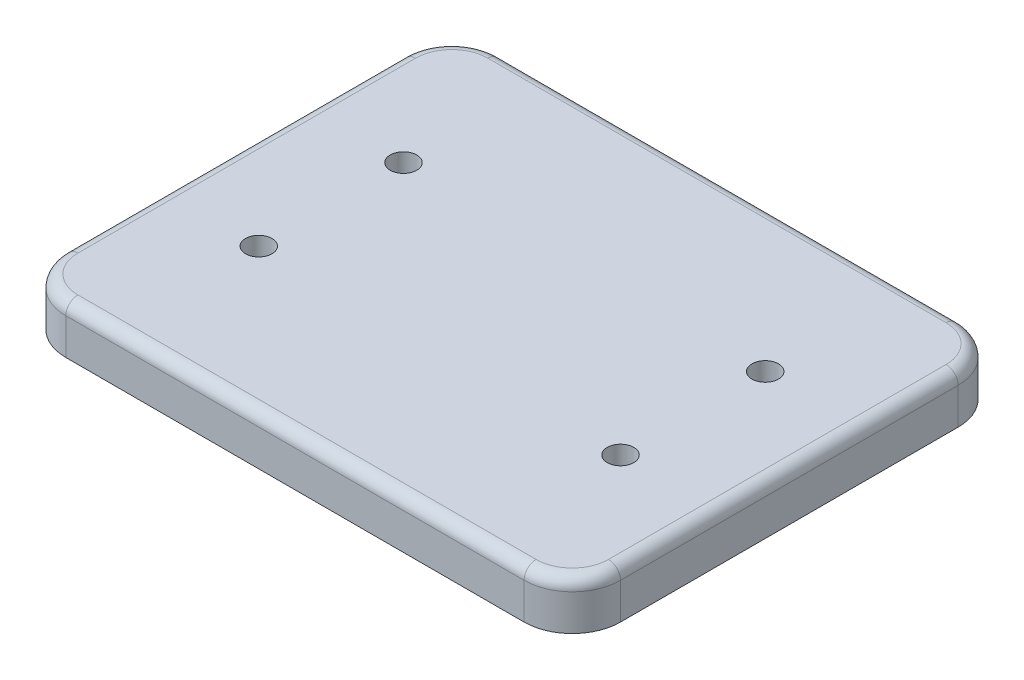
ISO-10303-21;
HEADER;
FILE_DESCRIPTION(('STEP AP214'),'2;1');
FILE_NAME('part.step','',(''),(''),'','','');
FILE_SCHEMA(('AUTOMOTIVE_DESIGN { 1 0 10303 214 1 1 1 1 }'));
ENDSEC;
DATA;
#1=APPLICATION_CONTEXT('core data for automotive mechanical design processes');
#2=APPLICATION_PROTOCOL_DEFINITION('international standard','automotive_design',2000,#1);
#3=PRODUCT_CONTEXT('',#1,'mechanical');
#4=PRODUCT('Part','Part','',(#3));
#5=PRODUCT_RELATED_PRODUCT_CATEGORY('part','',(#4));
#6=PRODUCT_DEFINITION_FORMATION('','',#4);
#7=PRODUCT_DEFINITION_CONTEXT('part definition',#1,'design');
#8=PRODUCT_DEFINITION('design','',#6,#7);
#9=PRODUCT_DEFINITION_SHAPE('','',#8);
#10=(LENGTH_UNIT() NAMED_UNIT(*) SI_UNIT(.MILLI.,.METRE.));
#11=(NAMED_UNIT(*) PLANE_ANGLE_UNIT() SI_UNIT($,.RADIAN.));
#12=(NAMED_UNIT(*) SI_UNIT($,.STERADIAN.) SOLID_ANGLE_UNIT());
#13=UNCERTAINTY_MEASURE_WITH_UNIT(LENGTH_MEASURE(1.E-05),#10,'distance_accuracy_value','');
#14=(GEOMETRIC_REPRESENTATION_CONTEXT(3) GLOBAL_UNCERTAINTY_ASSIGNED_CONTEXT((#13)) GLOBAL_UNIT_ASSIGNED_CONTEXT((#10,
#11,#12)) REPRESENTATION_CONTEXT('',''));
#15=CARTESIAN_POINT('',(0.,0.,0.));
#16=DIRECTION('',(0.,0.,1.));
#17=DIRECTION('',(1.,0.,0.));
#18=AXIS2_PLACEMENT_3D('',#15,#16,#17);
#19=CARTESIAN_POINT('',(75.,0.,30.));
#20=DIRECTION('',(0.,1.,0.));
#21=DIRECTION('',(0.,0.,1.));
#22=AXIS2_PLACEMENT_3D('',#19,#20,#21);
#23=CYLINDRICAL_SURFACE('',#22,5.5);
#24=CARTESIAN_POINT('',(75.,20.,30.));
#25=DIRECTION('',(0.,-1.,0.));
#26=DIRECTION('',(0.,0.,-1.));
#27=AXIS2_PLACEMENT_3D('',#24,#25,#26);
#28=CIRCLE('',#27,5.5);
#29=CARTESIAN_POINT('',(75.,20.,24.5));
#30=VERTEX_POINT('',#29);
#31=EDGE_CURVE('E297',#30,#30,#28,.T.);
#32=ORIENTED_EDGE('',*,*,#31,.F.);
#33=EDGE_LOOP('',(#32));
#34=FACE_BOUND('',#33,.T.);
#35=CARTESIAN_POINT('',(75.,11.,30.));
#36=DIRECTION('',(0.,-1.,0.));
#37=DIRECTION('',(0.,0.,-1.));
#38=AXIS2_PLACEMENT_3D('',#35,#36,#37);
#39=CIRCLE('',#38,5.5);
#40=CARTESIAN_POINT('',(75.,11.,24.5));
#41=VERTEX_POINT('',#40);
#42=EDGE_CURVE('E45',#41,#41,#39,.T.);
#43=ORIENTED_EDGE('',*,*,#42,.T.);
#44=EDGE_LOOP('',(#43));
#45=FACE_BOUND('',#44,.T.);
#46=ADVANCED_FACE('F41',(#34,#45),#23,.F.);
#47=CARTESIAN_POINT('',(-75.,0.,30.));
#48=DIRECTION('',(0.,1.,0.));
#49=DIRECTION('',(0.,0.,1.));
#50=AXIS2_PLACEMENT_3D('',#47,#48,#49);
#51=CYLINDRICAL_SURFACE('',#50,5.5);
#52=CARTESIAN_POINT('',(-75.,20.,30.));
#53=DIRECTION('',(0.,-1.,0.));
#54=DIRECTION('',(0.,0.,-1.));
#55=AXIS2_PLACEMENT_3D('',#52,#53,#54);
#56=CIRCLE('',#55,5.5);
#57=CARTESIAN_POINT('',(-75.,20.,24.5));
#58=VERTEX_POINT('',#57);
#59=EDGE_CURVE('E315',#58,#58,#56,.T.);
#60=ORIENTED_EDGE('',*,*,#59,.F.);
#61=EDGE_LOOP('',(#60));
#62=FACE_BOUND('',#61,.T.);
#63=CARTESIAN_POINT('',(-75.,11.,30.));
#64=DIRECTION('',(0.,-1.,0.));
#65=DIRECTION('',(0.,0.,-1.));
#66=AXIS2_PLACEMENT_3D('',#63,#64,#65);
#67=CIRCLE('',#66,5.5);
#68=CARTESIAN_POINT('',(-75.,11.,24.5));
#69=VERTEX_POINT('',#68);
#70=EDGE_CURVE('E288',#69,#69,#67,.T.);
#71=ORIENTED_EDGE('',*,*,#70,.T.);
#72=EDGE_LOOP('',(#71));
#73=FACE_BOUND('',#72,.T.);
#74=ADVANCED_FACE('F407',(#62,#73),#51,.F.);
#75=CARTESIAN_POINT('',(75.,0.,-30.));
#76=DIRECTION('',(0.,1.,0.));
#77=DIRECTION('',(0.,0.,1.));
#78=AXIS2_PLACEMENT_3D('',#75,#76,#77);
#79=CYLINDRICAL_SURFACE('',#78,5.5);
#80=CARTESIAN_POINT('',(75.,20.,-30.));
#81=DIRECTION('',(0.,1.,0.));
#82=DIRECTION('',(0.,0.,1.));
#83=AXIS2_PLACEMENT_3D('',#80,#81,#82);
#84=CIRCLE('',#83,5.5);
#85=CARTESIAN_POINT('',(75.,20.,-24.5));
#86=VERTEX_POINT('',#85);
#87=EDGE_CURVE('E168',#86,#86,#84,.T.);
#88=ORIENTED_EDGE('',*,*,#87,.T.);
#89=EDGE_LOOP('',(#88));
#90=FACE_BOUND('',#89,.T.);
#91=CARTESIAN_POINT('',(75.,11.,-30.));
#92=DIRECTION('',(0.,-1.,0.));
#93=DIRECTION('',(0.,0.,-1.));
#94=AXIS2_PLACEMENT_3D('',#91,#92,#93);
#95=CIRCLE('',#94,5.5);
#96=CARTESIAN_POINT('',(75.,11.,-35.5));
#97=VERTEX_POINT('',#96);
#98=EDGE_CURVE('E284',#97,#97,#95,.F.);
#99=ORIENTED_EDGE('',*,*,#98,.F.);
#100=EDGE_LOOP('',(#99));
#101=FACE_BOUND('',#100,.T.);
#102=ADVANCED_FACE('F344',(#90,#101),#79,.F.);
#103=CARTESIAN_POINT('',(-75.,0.,-30.));
#104=DIRECTION('',(0.,1.,0.));
#105=DIRECTION('',(0.,0.,1.));
#106=AXIS2_PLACEMENT_3D('',#103,#104,#105);
#107=CYLINDRICAL_SURFACE('',#106,5.5);
#108=CARTESIAN_POINT('',(-75.,20.,-30.));
#109=DIRECTION('',(0.,1.,0.));
#110=DIRECTION('',(0.,0.,1.));
#111=AXIS2_PLACEMENT_3D('',#108,#109,#110);
#112=CIRCLE('',#111,5.5);
#113=CARTESIAN_POINT('',(-75.,20.,-24.5));
#114=VERTEX_POINT('',#113);
#115=EDGE_CURVE('E258',#114,#114,#112,.T.);
#116=ORIENTED_EDGE('',*,*,#115,.T.);
#117=EDGE_LOOP('',(#116));
#118=FACE_BOUND('',#117,.T.);
#119=CARTESIAN_POINT('',(-75.,11.,-30.));
#120=DIRECTION('',(0.,-1.,0.));
#121=DIRECTION('',(0.,0.,-1.));
#122=AXIS2_PLACEMENT_3D('',#119,#120,#121);
#123=CIRCLE('',#122,5.5);
#124=CARTESIAN_POINT('',(-75.,11.,-35.5));
#125=VERTEX_POINT('',#124);
#126=EDGE_CURVE('E280',#125,#125,#123,.F.);
#127=ORIENTED_EDGE('',*,*,#126,.F.);
#128=EDGE_LOOP('',(#127));
#129=FACE_BOUND('',#128,.T.);
#130=ADVANCED_FACE('F436',(#118,#129),#107,.F.);
#131=CARTESIAN_POINT('',(-95.,20.,70.));
#132=DIRECTION('',(0.,-1.,0.));
#133=DIRECTION('',(0.,0.,-1.));
#134=AXIS2_PLACEMENT_3D('',#131,#132,#133);
#135=CYLINDRICAL_SURFACE('',#134,20.);
#136=DIRECTION('',(0.,-1.,0.));
#137=VECTOR('',#136,1.);
#138=CARTESIAN_POINT('',(-94.9999999999998,20.,90.));
#139=LINE('',#138,#137);
#140=CARTESIAN_POINT('',(-94.9999999999998,15.,90.));
#141=VERTEX_POINT('',#140);
#142=CARTESIAN_POINT('',(-94.9999999999998,0.,90.));
#143=VERTEX_POINT('',#142);
#144=EDGE_CURVE('E132',#141,#143,#139,.T.);
#145=ORIENTED_EDGE('',*,*,#144,.F.);
#146=CARTESIAN_POINT('',(-95.,15.,70.));
#147=DIRECTION('',(0.,1.,0.));
#148=DIRECTION('',(0.,0.,1.));
#149=AXIS2_PLACEMENT_3D('',#146,#147,#148);
#150=CIRCLE('',#149,20.);
#151=CARTESIAN_POINT('',(-115.,15.,69.9999999999999));
#152=VERTEX_POINT('',#151);
#153=EDGE_CURVE('E235',#141,#152,#150,.F.);
#154=ORIENTED_EDGE('',*,*,#153,.T.);
#155=DIRECTION('',(0.,-1.,0.));
#156=VECTOR('',#155,1.);
#157=CARTESIAN_POINT('',(-115.,20.,69.9999999999999));
#158=LINE('',#157,#156);
#159=CARTESIAN_POINT('',(-115.,0.,69.9999999999999));
#160=VERTEX_POINT('',#159);
#161=EDGE_CURVE('E158',#152,#160,#158,.T.);
#162=ORIENTED_EDGE('',*,*,#161,.T.);
#163=CARTESIAN_POINT('',(-95.,0.,70.));
#164=DIRECTION('',(0.,1.,0.));
#165=DIRECTION('',(0.,0.,1.));
#166=AXIS2_PLACEMENT_3D('',#163,#164,#165);
#167=CIRCLE('',#166,20.);
#168=EDGE_CURVE('E150',#160,#143,#167,.T.);
#169=ORIENTED_EDGE('',*,*,#168,.T.);
#170=EDGE_LOOP('',(#145,#154,#162,#169));
#171=FACE_BOUND('',#170,.T.);
#172=ADVANCED_FACE('F156',(#171),#135,.T.);
#173=CARTESIAN_POINT('',(-94.9999999999998,20.,90.));
#174=DIRECTION('',(0.,0.,-1.));
#175=DIRECTION('',(-1.,0.,0.));
#176=AXIS2_PLACEMENT_3D('',#173,#174,#175);
#177=PLANE('',#176);
#178=DIRECTION('',(0.,-1.,0.));
#179=VECTOR('',#178,1.);
#180=CARTESIAN_POINT('',(94.9999999999998,20.,90.));
#181=LINE('',#180,#179);
#182=CARTESIAN_POINT('',(94.9999999999998,15.,90.));
#183=VERTEX_POINT('',#182);
#184=CARTESIAN_POINT('',(94.9999999999998,0.,90.));
#185=VERTEX_POINT('',#184);
#186=EDGE_CURVE('E144',#183,#185,#181,.T.);
#187=ORIENTED_EDGE('',*,*,#186,.F.);
#188=DIRECTION('',(1.,0.,0.));
#189=VECTOR('',#188,1.);
#190=CARTESIAN_POINT('',(-94.9999999999998,15.,90.));
#191=LINE('',#190,#189);
#192=EDGE_CURVE('E11',#183,#141,#191,.F.);
#193=ORIENTED_EDGE('',*,*,#192,.T.);
#194=ORIENTED_EDGE('',*,*,#144,.T.);
#195=DIRECTION('',(1.,0.,0.));
#196=VECTOR('',#195,1.);
#197=CARTESIAN_POINT('',(-94.9999999999998,0.,90.));
#198=LINE('',#197,#196);
#199=EDGE_CURVE('E135',#143,#185,#198,.T.);
#200=ORIENTED_EDGE('',*,*,#199,.T.);
#201=EDGE_LOOP('',(#187,#193,#194,#200));
#202=FACE_BOUND('',#201,.T.);
#203=ADVANCED_FACE('F134',(#202),#177,.F.);
#204=CARTESIAN_POINT('',(95.,20.,70.));
#205=DIRECTION('',(0.,-1.,0.));
#206=DIRECTION('',(0.,0.,-1.));
#207=AXIS2_PLACEMENT_3D('',#204,#205,#206);
#208=CYLINDRICAL_SURFACE('',#207,20.);
#209=DIRECTION('',(0.,-1.,0.));
#210=VECTOR('',#209,1.);
#211=CARTESIAN_POINT('',(115.,20.,69.9999999999999));
#212=LINE('',#211,#210);
#213=CARTESIAN_POINT('',(115.,15.,69.9999999999999));
#214=VERTEX_POINT('',#213);
#215=CARTESIAN_POINT('',(115.,0.,69.9999999999999));
#216=VERTEX_POINT('',#215);
#217=EDGE_CURVE('E206',#214,#216,#212,.T.);
#218=ORIENTED_EDGE('',*,*,#217,.F.);
#219=CARTESIAN_POINT('',(95.,15.,70.));
#220=DIRECTION('',(0.,1.,0.));
#221=DIRECTION('',(0.,0.,1.));
#222=AXIS2_PLACEMENT_3D('',#219,#220,#221);
#223=CIRCLE('',#222,20.);
#224=EDGE_CURVE('E51',#214,#183,#223,.F.);
#225=ORIENTED_EDGE('',*,*,#224,.T.);
#226=ORIENTED_EDGE('',*,*,#186,.T.);
#227=CARTESIAN_POINT('',(95.,0.,70.));
#228=DIRECTION('',(0.,1.,0.));
#229=DIRECTION('',(0.,0.,-1.));
#230=AXIS2_PLACEMENT_3D('',#227,#228,#229);
#231=CIRCLE('',#230,20.);
#232=EDGE_CURVE('E153',#185,#216,#231,.T.);
#233=ORIENTED_EDGE('',*,*,#232,.T.);
#234=EDGE_LOOP('',(#218,#225,#226,#233));
#235=FACE_BOUND('',#234,.T.);
#236=ADVANCED_FACE('F627',(#235),#208,.T.);
#237=CARTESIAN_POINT('',(115.,20.,69.9999999999999));
#238=DIRECTION('',(-1.,0.,0.));
#239=DIRECTION('',(0.,0.,1.));
#240=AXIS2_PLACEMENT_3D('',#237,#238,#239);
#241=PLANE('',#240);
#242=DIRECTION('',(0.,-1.,0.));
#243=VECTOR('',#242,1.);
#244=CARTESIAN_POINT('',(115.,20.,-69.9999999999999));
#245=LINE('',#244,#243);
#246=CARTESIAN_POINT('',(115.,15.,-69.9999999999999));
#247=VERTEX_POINT('',#246);
#248=CARTESIAN_POINT('',(115.,0.,-69.9999999999999));
#249=VERTEX_POINT('',#248);
#250=EDGE_CURVE('E203',#247,#249,#245,.T.);
#251=ORIENTED_EDGE('',*,*,#250,.F.);
#252=DIRECTION('',(0.,0.,-1.));
#253=VECTOR('',#252,1.);
#254=CARTESIAN_POINT('',(115.,15.,69.9999999999999));
#255=LINE('',#254,#253);
#256=EDGE_CURVE('E66',#247,#214,#255,.F.);
#257=ORIENTED_EDGE('',*,*,#256,.T.);
#258=ORIENTED_EDGE('',*,*,#217,.T.);
#259=DIRECTION('',(0.,0.,-1.));
#260=VECTOR('',#259,1.);
#261=CARTESIAN_POINT('',(115.,0.,69.9999999999999));
#262=LINE('',#261,#260);
#263=EDGE_CURVE('E173',#216,#249,#262,.T.);
#264=ORIENTED_EDGE('',*,*,#263,.T.);
#265=EDGE_LOOP('',(#251,#257,#258,#264));
#266=FACE_BOUND('',#265,.T.);
#267=ADVANCED_FACE('F618',(#266),#241,.F.);
#268=CARTESIAN_POINT('',(95.,20.,-70.));
#269=DIRECTION('',(0.,-1.,0.));
#270=DIRECTION('',(0.,0.,-1.));
#271=AXIS2_PLACEMENT_3D('',#268,#269,#270);
#272=CYLINDRICAL_SURFACE('',#271,20.);
#273=DIRECTION('',(0.,-1.,0.));
#274=VECTOR('',#273,1.);
#275=CARTESIAN_POINT('',(94.9999999999998,20.,-90.));
#276=LINE('',#275,#274);
#277=CARTESIAN_POINT('',(94.9999999999998,15.,-90.));
#278=VERTEX_POINT('',#277);
#279=CARTESIAN_POINT('',(94.9999999999998,0.,-90.));
#280=VERTEX_POINT('',#279);
#281=EDGE_CURVE('E200',#278,#280,#276,.T.);
#282=ORIENTED_EDGE('',*,*,#281,.F.);
#283=CARTESIAN_POINT('',(95.,15.,-70.));
#284=DIRECTION('',(0.,1.,0.));
#285=DIRECTION('',(0.,0.,1.));
#286=AXIS2_PLACEMENT_3D('',#283,#284,#285);
#287=CIRCLE('',#286,20.);
#288=EDGE_CURVE('E247',#278,#247,#287,.F.);
#289=ORIENTED_EDGE('',*,*,#288,.T.);
#290=ORIENTED_EDGE('',*,*,#250,.T.);
#291=CARTESIAN_POINT('',(95.,0.,-70.));
#292=DIRECTION('',(0.,1.,0.));
#293=DIRECTION('',(0.,0.,1.));
#294=AXIS2_PLACEMENT_3D('',#291,#292,#293);
#295=CIRCLE('',#294,20.);
#296=EDGE_CURVE('E177',#249,#280,#295,.T.);
#297=ORIENTED_EDGE('',*,*,#296,.T.);
#298=EDGE_LOOP('',(#282,#289,#290,#297));
#299=FACE_BOUND('',#298,.T.);
#300=ADVANCED_FACE('F610',(#299),#272,.T.);
#301=CARTESIAN_POINT('',(94.9999999999998,20.,-90.));
#302=DIRECTION('',(0.,0.,1.));
#303=DIRECTION('',(1.,0.,0.));
#304=AXIS2_PLACEMENT_3D('',#301,#302,#303);
#305=PLANE('',#304);
#306=DIRECTION('',(0.,-1.,0.));
#307=VECTOR('',#306,1.);
#308=CARTESIAN_POINT('',(-94.9999999999999,20.,-90.));
#309=LINE('',#308,#307);
#310=CARTESIAN_POINT('',(-94.9999999999999,15.,-90.));
#311=VERTEX_POINT('',#310);
#312=CARTESIAN_POINT('',(-94.9999999999999,0.,-90.));
#313=VERTEX_POINT('',#312);
#314=EDGE_CURVE('E197',#311,#313,#309,.T.);
#315=ORIENTED_EDGE('',*,*,#314,.F.);
#316=DIRECTION('',(-1.,0.,0.));
#317=VECTOR('',#316,1.);
#318=CARTESIAN_POINT('',(94.9999999999999,15.,-90.));
#319=LINE('',#318,#317);
#320=EDGE_CURVE('E244',#311,#278,#319,.F.);
#321=ORIENTED_EDGE('',*,*,#320,.T.);
#322=ORIENTED_EDGE('',*,*,#281,.T.);
#323=DIRECTION('',(-1.,0.,0.));
#324=VECTOR('',#323,1.);
#325=CARTESIAN_POINT('',(94.9999999999998,0.,-90.));
#326=LINE('',#325,#324);
#327=EDGE_CURVE('E181',#280,#313,#326,.T.);
#328=ORIENTED_EDGE('',*,*,#327,.T.);
#329=EDGE_LOOP('',(#315,#321,#322,#328));
#330=FACE_BOUND('',#329,.T.);
#331=ADVANCED_FACE('F393',(#330),#305,.F.);
#332=CARTESIAN_POINT('',(-95.,20.,-70.));
#333=DIRECTION('',(0.,-1.,0.));
#334=DIRECTION('',(0.,0.,-1.));
#335=AXIS2_PLACEMENT_3D('',#332,#333,#334);
#336=CYLINDRICAL_SURFACE('',#335,20.);
#337=DIRECTION('',(0.,-1.,0.));
#338=VECTOR('',#337,1.);
#339=CARTESIAN_POINT('',(-115.,20.,-69.9999999999998));
#340=LINE('',#339,#338);
#341=CARTESIAN_POINT('',(-115.,15.,-69.9999999999998));
#342=VERTEX_POINT('',#341);
#343=CARTESIAN_POINT('',(-115.,0.,-69.9999999999998));
#344=VERTEX_POINT('',#343);
#345=EDGE_CURVE('E194',#342,#344,#340,.T.);
#346=ORIENTED_EDGE('',*,*,#345,.F.);
#347=CARTESIAN_POINT('',(-95.,15.,-70.));
#348=DIRECTION('',(0.,1.,0.));
#349=DIRECTION('',(0.,0.,1.));
#350=AXIS2_PLACEMENT_3D('',#347,#348,#349);
#351=CIRCLE('',#350,20.);
#352=EDGE_CURVE('E241',#342,#311,#351,.F.);
#353=ORIENTED_EDGE('',*,*,#352,.T.);
#354=ORIENTED_EDGE('',*,*,#314,.T.);
#355=CARTESIAN_POINT('',(-95.,0.,-70.));
#356=DIRECTION('',(0.,1.,0.));
#357=DIRECTION('',(0.,0.,1.));
#358=AXIS2_PLACEMENT_3D('',#355,#356,#357);
#359=CIRCLE('',#358,20.);
#360=EDGE_CURVE('E185',#313,#344,#359,.T.);
#361=ORIENTED_EDGE('',*,*,#360,.T.);
#362=EDGE_LOOP('',(#346,#353,#354,#361));
#363=FACE_BOUND('',#362,.T.);
#364=ADVANCED_FACE('F391',(#363),#336,.T.);
#365=CARTESIAN_POINT('',(-115.,20.,-69.9999999999998));
#366=DIRECTION('',(1.,0.,0.));
#367=DIRECTION('',(0.,0.,-1.));
#368=AXIS2_PLACEMENT_3D('',#365,#366,#367);
#369=PLANE('',#368);
#370=ORIENTED_EDGE('',*,*,#161,.F.);
#371=DIRECTION('',(0.,0.,1.));
#372=VECTOR('',#371,1.);
#373=CARTESIAN_POINT('',(-115.,15.,-69.9999999999998));
#374=LINE('',#373,#372);
#375=EDGE_CURVE('E238',#152,#342,#374,.F.);
#376=ORIENTED_EDGE('',*,*,#375,.T.);
#377=ORIENTED_EDGE('',*,*,#345,.T.);
#378=DIRECTION('',(0.,0.,1.));
#379=VECTOR('',#378,1.);
#380=CARTESIAN_POINT('',(-115.,0.,-69.9999999999998));
#381=LINE('',#380,#379);
#382=EDGE_CURVE('E189',#344,#160,#381,.T.);
#383=ORIENTED_EDGE('',*,*,#382,.T.);
#384=EDGE_LOOP('',(#370,#376,#377,#383));
#385=FACE_BOUND('',#384,.T.);
#386=ADVANCED_FACE('F350',(#385),#369,.F.);
#387=CARTESIAN_POINT('',(-95.,20.,70.));
#388=DIRECTION('',(0.,1.,0.));
#389=DIRECTION('',(0.,0.,1.));
#390=AXIS2_PLACEMENT_3D('',#387,#388,#389);
#391=PLANE('',#390);
#392=ORIENTED_EDGE('',*,*,#59,.T.);
#393=EDGE_LOOP('',(#392));
#394=FACE_BOUND('',#393,.T.);
#395=ORIENTED_EDGE('',*,*,#31,.T.);
#396=EDGE_LOOP('',(#395));
#397=FACE_BOUND('',#396,.T.);
#398=ORIENTED_EDGE('',*,*,#115,.F.);
#399=EDGE_LOOP('',(#398));
#400=FACE_BOUND('',#399,.T.);
#401=ORIENTED_EDGE('',*,*,#87,.F.);
#402=EDGE_LOOP('',(#401));
#403=FACE_BOUND('',#402,.T.);
#404=DIRECTION('',(0.,0.,1.));
#405=VECTOR('',#404,1.);
#406=CARTESIAN_POINT('',(-110.,20.,69.9999999999999));
#407=LINE('',#406,#405);
#408=CARTESIAN_POINT('',(-110.,20.,-69.9999999999998));
#409=VERTEX_POINT('',#408);
#410=CARTESIAN_POINT('',(-110.,20.,69.9999999999999));
#411=VERTEX_POINT('',#410);
#412=EDGE_CURVE('E228',#409,#411,#407,.T.);
#413=ORIENTED_EDGE('',*,*,#412,.T.);
#414=CARTESIAN_POINT('',(-95.,20.,70.));
#415=DIRECTION('',(0.,1.,0.));
#416=DIRECTION('',(0.,0.,1.));
#417=AXIS2_PLACEMENT_3D('',#414,#415,#416);
#418=CIRCLE('',#417,15.);
#419=CARTESIAN_POINT('',(-94.9999999999999,20.,85.));
#420=VERTEX_POINT('',#419);
#421=EDGE_CURVE('E231',#411,#420,#418,.T.);
#422=ORIENTED_EDGE('',*,*,#421,.T.);
#423=DIRECTION('',(1.,0.,0.));
#424=VECTOR('',#423,1.);
#425=CARTESIAN_POINT('',(94.9999999999998,20.,85.));
#426=LINE('',#425,#424);
#427=CARTESIAN_POINT('',(94.9999999999999,20.,85.));
#428=VERTEX_POINT('',#427);
#429=EDGE_CURVE('E143',#420,#428,#426,.T.);
#430=ORIENTED_EDGE('',*,*,#429,.T.);
#431=CARTESIAN_POINT('',(95.,20.,70.));
#432=DIRECTION('',(0.,1.,0.));
#433=DIRECTION('',(0.,0.,1.));
#434=AXIS2_PLACEMENT_3D('',#431,#432,#433);
#435=CIRCLE('',#434,15.);
#436=CARTESIAN_POINT('',(110.,20.,69.9999999999999));
#437=VERTEX_POINT('',#436);
#438=EDGE_CURVE('E213',#428,#437,#435,.T.);
#439=ORIENTED_EDGE('',*,*,#438,.T.);
#440=DIRECTION('',(0.,0.,-1.));
#441=VECTOR('',#440,1.);
#442=CARTESIAN_POINT('',(110.,20.,-69.9999999999999));
#443=LINE('',#442,#441);
#444=CARTESIAN_POINT('',(110.,20.,-69.9999999999999));
#445=VERTEX_POINT('',#444);
#446=EDGE_CURVE('E216',#437,#445,#443,.T.);
#447=ORIENTED_EDGE('',*,*,#446,.T.);
#448=CARTESIAN_POINT('',(95.,20.,-70.));
#449=DIRECTION('',(0.,1.,0.));
#450=DIRECTION('',(0.,0.,1.));
#451=AXIS2_PLACEMENT_3D('',#448,#449,#450);
#452=CIRCLE('',#451,15.);
#453=CARTESIAN_POINT('',(94.9999999999998,20.,-85.));
#454=VERTEX_POINT('',#453);
#455=EDGE_CURVE('E219',#445,#454,#452,.T.);
#456=ORIENTED_EDGE('',*,*,#455,.T.);
#457=DIRECTION('',(-1.,0.,0.));
#458=VECTOR('',#457,1.);
#459=CARTESIAN_POINT('',(-94.9999999999999,20.,-85.));
#460=LINE('',#459,#458);
#461=CARTESIAN_POINT('',(-94.9999999999999,20.,-85.));
#462=VERTEX_POINT('',#461);
#463=EDGE_CURVE('E222',#454,#462,#460,.T.);
#464=ORIENTED_EDGE('',*,*,#463,.T.);
#465=CARTESIAN_POINT('',(-95.,20.,-70.));
#466=DIRECTION('',(0.,1.,0.));
#467=DIRECTION('',(0.,0.,1.));
#468=AXIS2_PLACEMENT_3D('',#465,#466,#467);
#469=CIRCLE('',#468,15.);
#470=EDGE_CURVE('E225',#462,#409,#469,.T.);
#471=ORIENTED_EDGE('',*,*,#470,.T.);
#472=EDGE_LOOP('',(#413,#422,#430,#439,#447,#456,#464,#471));
#473=FACE_BOUND('',#472,.T.);
#474=ADVANCED_FACE('F347',(#394,#397,#400,#403,#473),#391,.T.);
#475=CARTESIAN_POINT('',(-95.,0.,70.));
#476=DIRECTION('',(0.,1.,0.));
#477=DIRECTION('',(0.,0.,1.));
#478=AXIS2_PLACEMENT_3D('',#475,#476,#477);
#479=PLANE('',#478);
#480=CARTESIAN_POINT('',(-75.,0.,30.));
#481=DIRECTION('',(0.,1.,0.));
#482=DIRECTION('',(0.,0.,1.));
#483=AXIS2_PLACEMENT_3D('',#480,#481,#482);
#484=CIRCLE('',#483,9.);
#485=CARTESIAN_POINT('',(-75.,0.,39.));
#486=VERTEX_POINT('',#485);
#487=EDGE_CURVE('E299',#486,#486,#484,.T.);
#488=ORIENTED_EDGE('',*,*,#487,.T.);
#489=EDGE_LOOP('',(#488));
#490=FACE_BOUND('',#489,.T.);
#491=CARTESIAN_POINT('',(75.,0.,30.));
#492=DIRECTION('',(0.,1.,0.));
#493=DIRECTION('',(0.,0.,1.));
#494=AXIS2_PLACEMENT_3D('',#491,#492,#493);
#495=CIRCLE('',#494,9.);
#496=CARTESIAN_POINT('',(75.,0.,39.));
#497=VERTEX_POINT('',#496);
#498=EDGE_CURVE('E311',#497,#497,#495,.T.);
#499=ORIENTED_EDGE('',*,*,#498,.T.);
#500=EDGE_LOOP('',(#499));
#501=FACE_BOUND('',#500,.T.);
#502=CARTESIAN_POINT('',(-75.,0.,-30.));
#503=DIRECTION('',(0.,-1.,0.));
#504=DIRECTION('',(0.,0.,-1.));
#505=AXIS2_PLACEMENT_3D('',#502,#503,#504);
#506=CIRCLE('',#505,9.);
#507=CARTESIAN_POINT('',(-75.,0.,-39.));
#508=VERTEX_POINT('',#507);
#509=EDGE_CURVE('E326',#508,#508,#506,.T.);
#510=ORIENTED_EDGE('',*,*,#509,.F.);
#511=EDGE_LOOP('',(#510));
#512=FACE_BOUND('',#511,.T.);
#513=CARTESIAN_POINT('',(75.,0.,-30.));
#514=DIRECTION('',(0.,-1.,0.));
#515=DIRECTION('',(0.,0.,-1.));
#516=AXIS2_PLACEMENT_3D('',#513,#514,#515);
#517=CIRCLE('',#516,9.);
#518=CARTESIAN_POINT('',(75.,0.,-39.));
#519=VERTEX_POINT('',#518);
#520=EDGE_CURVE('E319',#519,#519,#517,.T.);
#521=ORIENTED_EDGE('',*,*,#520,.F.);
#522=EDGE_LOOP('',(#521));
#523=FACE_BOUND('',#522,.T.);
#524=ORIENTED_EDGE('',*,*,#168,.F.);
#525=ORIENTED_EDGE('',*,*,#382,.F.);
#526=ORIENTED_EDGE('',*,*,#360,.F.);
#527=ORIENTED_EDGE('',*,*,#327,.F.);
#528=ORIENTED_EDGE('',*,*,#296,.F.);
#529=ORIENTED_EDGE('',*,*,#263,.F.);
#530=ORIENTED_EDGE('',*,*,#232,.F.);
#531=ORIENTED_EDGE('',*,*,#199,.F.);
#532=EDGE_LOOP('',(#524,#525,#526,#527,#528,#529,#530,#531));
#533=FACE_BOUND('',#532,.T.);
#534=ADVANCED_FACE('F148',(#490,#501,#512,#523,#533),#479,.F.);
#535=CARTESIAN_POINT('',(95.,15.,-70.));
#536=DIRECTION('',(0.,1.,0.));
#537=DIRECTION('',(0.,0.,1.));
#538=AXIS2_PLACEMENT_3D('',#535,#536,#537);
#539=TOROIDAL_SURFACE('',#538,15.,5.);
#540=CARTESIAN_POINT('',(110.,15.,-69.9999999999999));
#541=DIRECTION('',(0.,0.,1.));
#542=DIRECTION('',(1.,0.,0.));
#543=AXIS2_PLACEMENT_3D('',#540,#541,#542);
#544=CIRCLE('',#543,5.);
#545=EDGE_CURVE('E165',#247,#445,#544,.T.);
#546=ORIENTED_EDGE('',*,*,#545,.F.);
#547=ORIENTED_EDGE('',*,*,#288,.F.);
#548=CARTESIAN_POINT('',(94.9999999999998,15.,-85.));
#549=DIRECTION('',(-1.,0.,0.));
#550=DIRECTION('',(0.,0.,1.));
#551=AXIS2_PLACEMENT_3D('',#548,#549,#550);
#552=CIRCLE('',#551,5.);
#553=EDGE_CURVE('E161',#454,#278,#552,.T.);
#554=ORIENTED_EDGE('',*,*,#553,.F.);
#555=ORIENTED_EDGE('',*,*,#455,.F.);
#556=EDGE_LOOP('',(#546,#547,#554,#555));
#557=FACE_BOUND('',#556,.T.);
#558=ADVANCED_FACE('F43',(#557),#539,.T.);
#559=CARTESIAN_POINT('',(-95.,15.,-85.));
#560=DIRECTION('',(1.,0.,0.));
#561=DIRECTION('',(0.,0.,-1.));
#562=AXIS2_PLACEMENT_3D('',#559,#560,#561);
#563=CYLINDRICAL_SURFACE('',#562,5.);
#564=ORIENTED_EDGE('',*,*,#553,.T.);
#565=ORIENTED_EDGE('',*,*,#320,.F.);
#566=CARTESIAN_POINT('',(-94.9999999999999,15.,-85.));
#567=DIRECTION('',(-1.,0.,0.));
#568=DIRECTION('',(0.,0.,1.));
#569=AXIS2_PLACEMENT_3D('',#566,#567,#568);
#570=CIRCLE('',#569,5.);
#571=EDGE_CURVE('E273',#462,#311,#570,.T.);
#572=ORIENTED_EDGE('',*,*,#571,.F.);
#573=ORIENTED_EDGE('',*,*,#463,.F.);
#574=EDGE_LOOP('',(#564,#565,#572,#573));
#575=FACE_BOUND('',#574,.T.);
#576=ADVANCED_FACE('F384',(#575),#563,.T.);
#577=CARTESIAN_POINT('',(110.,15.,70.));
#578=DIRECTION('',(0.,0.,1.));
#579=DIRECTION('',(1.,0.,0.));
#580=AXIS2_PLACEMENT_3D('',#577,#578,#579);
#581=CYLINDRICAL_SURFACE('',#580,5.);
#582=ORIENTED_EDGE('',*,*,#545,.T.);
#583=ORIENTED_EDGE('',*,*,#446,.F.);
#584=CARTESIAN_POINT('',(110.,15.,69.9999999999999));
#585=DIRECTION('',(0.,0.,1.));
#586=DIRECTION('',(1.,0.,0.));
#587=AXIS2_PLACEMENT_3D('',#584,#585,#586);
#588=CIRCLE('',#587,5.);
#589=EDGE_CURVE('E269',#214,#437,#588,.T.);
#590=ORIENTED_EDGE('',*,*,#589,.F.);
#591=ORIENTED_EDGE('',*,*,#256,.F.);
#592=EDGE_LOOP('',(#582,#583,#590,#591));
#593=FACE_BOUND('',#592,.T.);
#594=ADVANCED_FACE('F374',(#593),#581,.T.);
#595=CARTESIAN_POINT('',(-95.,15.,-70.));
#596=DIRECTION('',(0.,1.,0.));
#597=DIRECTION('',(0.,0.,1.));
#598=AXIS2_PLACEMENT_3D('',#595,#596,#597);
#599=TOROIDAL_SURFACE('',#598,15.,5.);
#600=ORIENTED_EDGE('',*,*,#571,.T.);
#601=ORIENTED_EDGE('',*,*,#352,.F.);
#602=CARTESIAN_POINT('',(-110.,15.,-69.9999999999998));
#603=DIRECTION('',(0.,0.,1.));
#604=DIRECTION('',(1.,0.,0.));
#605=AXIS2_PLACEMENT_3D('',#602,#603,#604);
#606=CIRCLE('',#605,5.);
#607=EDGE_CURVE('E265',#409,#342,#606,.T.);
#608=ORIENTED_EDGE('',*,*,#607,.F.);
#609=ORIENTED_EDGE('',*,*,#470,.F.);
#610=EDGE_LOOP('',(#600,#601,#608,#609));
#611=FACE_BOUND('',#610,.T.);
#612=ADVANCED_FACE('F387',(#611),#599,.T.);
#613=CARTESIAN_POINT('',(95.,15.,70.));
#614=DIRECTION('',(0.,1.,0.));
#615=DIRECTION('',(0.,0.,1.));
#616=AXIS2_PLACEMENT_3D('',#613,#614,#615);
#617=TOROIDAL_SURFACE('',#616,15.,5.);
#618=ORIENTED_EDGE('',*,*,#589,.T.);
#619=ORIENTED_EDGE('',*,*,#438,.F.);
#620=CARTESIAN_POINT('',(94.9999999999999,15.,85.));
#621=DIRECTION('',(-1.,0.,0.));
#622=DIRECTION('',(0.,0.,1.));
#623=AXIS2_PLACEMENT_3D('',#620,#621,#622);
#624=CIRCLE('',#623,5.);
#625=EDGE_CURVE('E261',#183,#428,#624,.T.);
#626=ORIENTED_EDGE('',*,*,#625,.F.);
#627=ORIENTED_EDGE('',*,*,#224,.F.);
#628=EDGE_LOOP('',(#618,#619,#626,#627));
#629=FACE_BOUND('',#628,.T.);
#630=ADVANCED_FACE('F371',(#629),#617,.T.);
#631=CARTESIAN_POINT('',(-110.,15.,70.));
#632=DIRECTION('',(0.,0.,-1.));
#633=DIRECTION('',(-1.,0.,0.));
#634=AXIS2_PLACEMENT_3D('',#631,#632,#633);
#635=CYLINDRICAL_SURFACE('',#634,5.);
#636=ORIENTED_EDGE('',*,*,#607,.T.);
#637=ORIENTED_EDGE('',*,*,#375,.F.);
#638=CARTESIAN_POINT('',(-110.,15.,69.9999999999999));
#639=DIRECTION('',(0.,0.,1.));
#640=DIRECTION('',(1.,0.,0.));
#641=AXIS2_PLACEMENT_3D('',#638,#639,#640);
#642=CIRCLE('',#641,5.);
#643=EDGE_CURVE('E257',#411,#152,#642,.T.);
#644=ORIENTED_EDGE('',*,*,#643,.F.);
#645=ORIENTED_EDGE('',*,*,#412,.F.);
#646=EDGE_LOOP('',(#636,#637,#644,#645));
#647=FACE_BOUND('',#646,.T.);
#648=ADVANCED_FACE('F360',(#647),#635,.T.);
#649=CARTESIAN_POINT('',(-95.,15.,85.));
#650=DIRECTION('',(-1.,0.,0.));
#651=DIRECTION('',(0.,0.,1.));
#652=AXIS2_PLACEMENT_3D('',#649,#650,#651);
#653=CYLINDRICAL_SURFACE('',#652,5.);
#654=ORIENTED_EDGE('',*,*,#625,.T.);
#655=ORIENTED_EDGE('',*,*,#429,.F.);
#656=CARTESIAN_POINT('',(-94.9999999999998,15.,85.));
#657=DIRECTION('',(-1.,0.,0.));
#658=DIRECTION('',(0.,-1.,0.));
#659=AXIS2_PLACEMENT_3D('',#656,#657,#658);
#660=CIRCLE('',#659,5.);
#661=EDGE_CURVE('E254',#141,#420,#660,.T.);
#662=ORIENTED_EDGE('',*,*,#661,.F.);
#663=ORIENTED_EDGE('',*,*,#192,.F.);
#664=EDGE_LOOP('',(#654,#655,#662,#663));
#665=FACE_BOUND('',#664,.T.);
#666=ADVANCED_FACE('F366',(#665),#653,.T.);
#667=CARTESIAN_POINT('',(-95.,15.,70.));
#668=DIRECTION('',(0.,1.,0.));
#669=DIRECTION('',(0.,0.,1.));
#670=AXIS2_PLACEMENT_3D('',#667,#668,#669);
#671=TOROIDAL_SURFACE('',#670,15.,5.);
#672=ORIENTED_EDGE('',*,*,#643,.T.);
#673=ORIENTED_EDGE('',*,*,#153,.F.);
#674=ORIENTED_EDGE('',*,*,#661,.T.);
#675=ORIENTED_EDGE('',*,*,#421,.F.);
#676=EDGE_LOOP('',(#672,#673,#674,#675));
#677=FACE_BOUND('',#676,.T.);
#678=ADVANCED_FACE('F362',(#677),#671,.T.);
#679=CARTESIAN_POINT('',(-75.,11.,-30.));
#680=DIRECTION('',(0.,-1.,0.));
#681=DIRECTION('',(0.,0.,-1.));
#682=AXIS2_PLACEMENT_3D('',#679,#680,#681);
#683=PLANE('',#682);
#684=CARTESIAN_POINT('',(-75.,11.,-30.));
#685=DIRECTION('',(0.,-1.,0.));
#686=DIRECTION('',(0.,0.,-1.));
#687=AXIS2_PLACEMENT_3D('',#684,#685,#686);
#688=CIRCLE('',#687,9.);
#689=CARTESIAN_POINT('',(-75.,11.,-39.));
#690=VERTEX_POINT('',#689);
#691=EDGE_CURVE('E285',#690,#690,#688,.T.);
#692=ORIENTED_EDGE('',*,*,#691,.T.);
#693=EDGE_LOOP('',(#692));
#694=FACE_BOUND('',#693,.T.);
#695=ORIENTED_EDGE('',*,*,#126,.T.);
#696=EDGE_LOOP('',(#695));
#697=FACE_BOUND('',#696,.T.);
#698=ADVANCED_FACE('F419',(#694,#697),#683,.T.);
#699=CARTESIAN_POINT('',(-75.,11.,-30.));
#700=DIRECTION('',(0.,-1.,0.));
#701=DIRECTION('',(0.,0.,-1.));
#702=AXIS2_PLACEMENT_3D('',#699,#700,#701);
#703=CYLINDRICAL_SURFACE('',#702,9.);
#704=ORIENTED_EDGE('',*,*,#691,.F.);
#705=EDGE_LOOP('',(#704));
#706=FACE_BOUND('',#705,.T.);
#707=ORIENTED_EDGE('',*,*,#509,.T.);
#708=EDGE_LOOP('',(#707));
#709=FACE_BOUND('',#708,.T.);
#710=ADVANCED_FACE('F422',(#706,#709),#703,.F.);
#711=CARTESIAN_POINT('',(75.,11.,-30.));
#712=DIRECTION('',(0.,-1.,0.));
#713=DIRECTION('',(0.,0.,-1.));
#714=AXIS2_PLACEMENT_3D('',#711,#712,#713);
#715=PLANE('',#714);
#716=CARTESIAN_POINT('',(75.,11.,-30.));
#717=DIRECTION('',(0.,-1.,0.));
#718=DIRECTION('',(0.,0.,-1.));
#719=AXIS2_PLACEMENT_3D('',#716,#717,#718);
#720=CIRCLE('',#719,9.);
#721=CARTESIAN_POINT('',(75.,11.,-39.));
#722=VERTEX_POINT('',#721);
#723=EDGE_CURVE('E330',#722,#722,#720,.T.);
#724=ORIENTED_EDGE('',*,*,#723,.T.);
#725=EDGE_LOOP('',(#724));
#726=FACE_BOUND('',#725,.T.);
#727=ORIENTED_EDGE('',*,*,#98,.T.);
#728=EDGE_LOOP('',(#727));
#729=FACE_BOUND('',#728,.T.);
#730=ADVANCED_FACE('F426',(#726,#729),#715,.T.);
#731=CARTESIAN_POINT('',(75.,11.,-30.));
#732=DIRECTION('',(0.,-1.,0.));
#733=DIRECTION('',(0.,0.,-1.));
#734=AXIS2_PLACEMENT_3D('',#731,#732,#733);
#735=CYLINDRICAL_SURFACE('',#734,9.);
#736=ORIENTED_EDGE('',*,*,#723,.F.);
#737=EDGE_LOOP('',(#736));
#738=FACE_BOUND('',#737,.T.);
#739=ORIENTED_EDGE('',*,*,#520,.T.);
#740=EDGE_LOOP('',(#739));
#741=FACE_BOUND('',#740,.T.);
#742=ADVANCED_FACE('F430',(#738,#741),#735,.F.);
#743=CARTESIAN_POINT('',(-75.,11.,30.));
#744=DIRECTION('',(0.,-1.,0.));
#745=DIRECTION('',(0.,0.,-1.));
#746=AXIS2_PLACEMENT_3D('',#743,#744,#745);
#747=CYLINDRICAL_SURFACE('',#746,9.);
#748=CARTESIAN_POINT('',(-75.,11.,30.));
#749=DIRECTION('',(0.,1.,0.));
#750=DIRECTION('',(0.,0.,1.));
#751=AXIS2_PLACEMENT_3D('',#748,#749,#750);
#752=CIRCLE('',#751,9.);
#753=CARTESIAN_POINT('',(-75.,11.,39.));
#754=VERTEX_POINT('',#753);
#755=EDGE_CURVE('E291',#754,#754,#752,.T.);
#756=ORIENTED_EDGE('',*,*,#755,.T.);
#757=EDGE_LOOP('',(#756));
#758=FACE_BOUND('',#757,.T.);
#759=ORIENTED_EDGE('',*,*,#487,.F.);
#760=EDGE_LOOP('',(#759));
#761=FACE_BOUND('',#760,.T.);
#762=ADVANCED_FACE('F434',(#758,#761),#747,.F.);
#763=CARTESIAN_POINT('',(-75.,11.,30.));
#764=DIRECTION('',(0.,-1.,0.));
#765=DIRECTION('',(0.,0.,1.));
#766=AXIS2_PLACEMENT_3D('',#763,#764,#765);
#767=PLANE('',#766);
#768=ORIENTED_EDGE('',*,*,#70,.F.);
#769=EDGE_LOOP('',(#768));
#770=FACE_BOUND('',#769,.T.);
#771=ORIENTED_EDGE('',*,*,#755,.F.);
#772=EDGE_LOOP('',(#771));
#773=FACE_BOUND('',#772,.T.);
#774=ADVANCED_FACE('F458',(#770,#773),#767,.T.);
#775=CARTESIAN_POINT('',(75.,11.,30.));
#776=DIRECTION('',(0.,-1.,0.));
#777=DIRECTION('',(0.,0.,-1.));
#778=AXIS2_PLACEMENT_3D('',#775,#776,#777);
#779=CYLINDRICAL_SURFACE('',#778,9.);
#780=CARTESIAN_POINT('',(75.,11.,30.));
#781=DIRECTION('',(0.,1.,0.));
#782=DIRECTION('',(0.,0.,1.));
#783=AXIS2_PLACEMENT_3D('',#780,#781,#782);
#784=CIRCLE('',#783,9.);
#785=CARTESIAN_POINT('',(75.,11.,39.));
#786=VERTEX_POINT('',#785);
#787=EDGE_CURVE('E305',#786,#786,#784,.T.);
#788=ORIENTED_EDGE('',*,*,#787,.T.);
#789=EDGE_LOOP('',(#788));
#790=FACE_BOUND('',#789,.T.);
#791=ORIENTED_EDGE('',*,*,#498,.F.);
#792=EDGE_LOOP('',(#791));
#793=FACE_BOUND('',#792,.T.);
#794=ADVANCED_FACE('F455',(#790,#793),#779,.F.);
#795=CARTESIAN_POINT('',(75.,11.,30.));
#796=DIRECTION('',(0.,-1.,0.));
#797=DIRECTION('',(0.,0.,1.));
#798=AXIS2_PLACEMENT_3D('',#795,#796,#797);
#799=PLANE('',#798);
#800=ORIENTED_EDGE('',*,*,#42,.F.);
#801=EDGE_LOOP('',(#800));
#802=FACE_BOUND('',#801,.T.);
#803=ORIENTED_EDGE('',*,*,#787,.F.);
#804=EDGE_LOOP('',(#803));
#805=FACE_BOUND('',#804,.T.);
#806=ADVANCED_FACE('F457',(#802,#805),#799,.T.);
#807=CLOSED_SHELL('',(#46,#74,#102,#130,#172,#203,#236,#267,#300,#331,#364,#386,#474,#534,#558,
#576,#594,#612,#630,#648,#666,#678,#698,#710,#730,#742,#762,#774,#794,#806));
#808=MANIFOLD_SOLID_BREP('B2',#807);
#809=ADVANCED_BREP_SHAPE_REPRESENTATION('',(#18,#808),#14);
#810=SHAPE_DEFINITION_REPRESENTATION(#9,#809);
ENDSEC;
END-ISO-10303-21;
